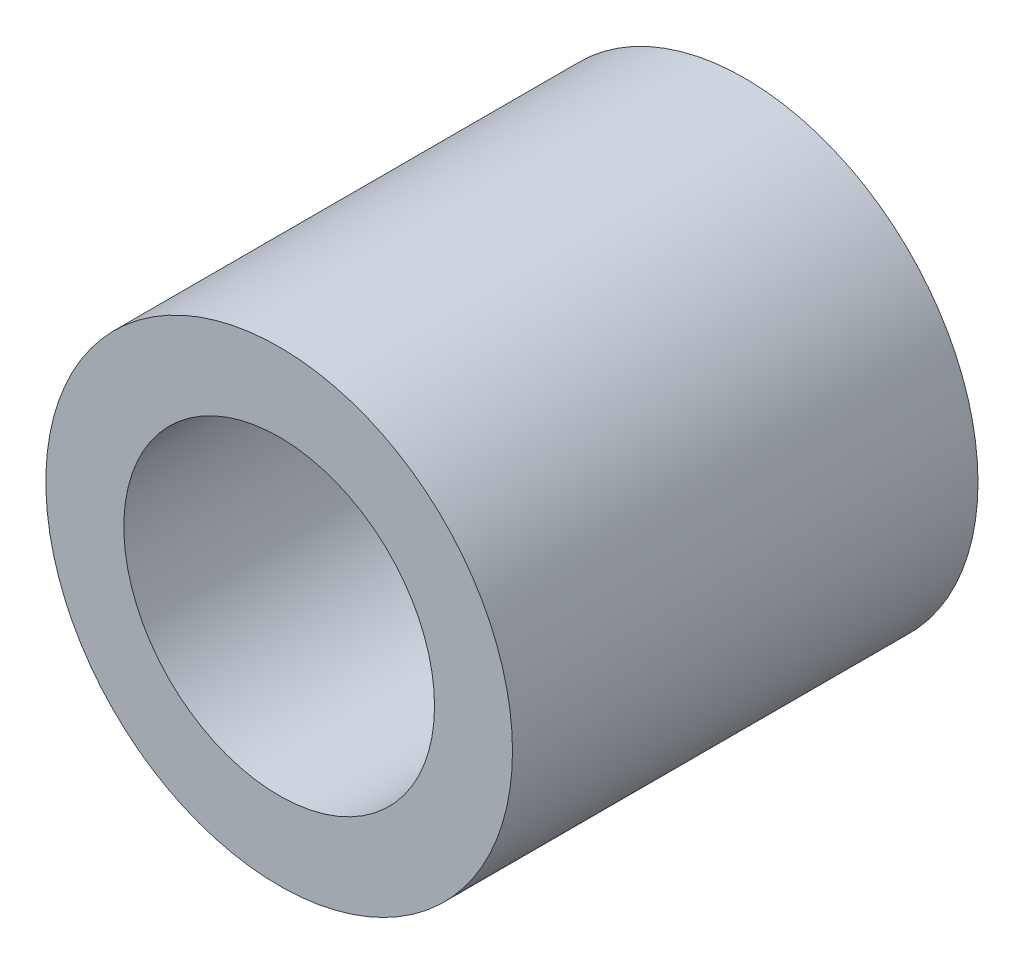
ISO-10303-21;
HEADER;
FILE_DESCRIPTION(('STEP AP214'),'2;1');
FILE_NAME('part.step','',(''),(''),'','','');
FILE_SCHEMA(('AUTOMOTIVE_DESIGN { 1 0 10303 214 1 1 1 1 }'));
ENDSEC;
DATA;
#1=APPLICATION_CONTEXT('core data for automotive mechanical design processes');
#2=APPLICATION_PROTOCOL_DEFINITION('international standard','automotive_design',2000,#1);
#3=PRODUCT_CONTEXT('',#1,'mechanical');
#4=PRODUCT('Part','Part','',(#3));
#5=PRODUCT_RELATED_PRODUCT_CATEGORY('part','',(#4));
#6=PRODUCT_DEFINITION_FORMATION('','',#4);
#7=PRODUCT_DEFINITION_CONTEXT('part definition',#1,'design');
#8=PRODUCT_DEFINITION('design','',#6,#7);
#9=PRODUCT_DEFINITION_SHAPE('','',#8);
#10=(LENGTH_UNIT() NAMED_UNIT(*) SI_UNIT(.MILLI.,.METRE.));
#11=(NAMED_UNIT(*) PLANE_ANGLE_UNIT() SI_UNIT($,.RADIAN.));
#12=(NAMED_UNIT(*) SI_UNIT($,.STERADIAN.) SOLID_ANGLE_UNIT());
#13=UNCERTAINTY_MEASURE_WITH_UNIT(LENGTH_MEASURE(1.E-05),#10,'distance_accuracy_value','');
#14=(GEOMETRIC_REPRESENTATION_CONTEXT(3) GLOBAL_UNCERTAINTY_ASSIGNED_CONTEXT((#13)) GLOBAL_UNIT_ASSIGNED_CONTEXT((#10,
#11,#12)) REPRESENTATION_CONTEXT('',''));
#15=CARTESIAN_POINT('',(0.,0.,0.));
#16=DIRECTION('',(0.,0.,1.));
#17=DIRECTION('',(1.,0.,0.));
#18=AXIS2_PLACEMENT_3D('',#15,#16,#17);
#19=CARTESIAN_POINT('',(0.,0.,6.));
#20=DIRECTION('',(0.,0.,1.));
#21=DIRECTION('',(1.,0.,0.));
#22=AXIS2_PLACEMENT_3D('',#19,#20,#21);
#23=PLANE('',#22);
#24=CARTESIAN_POINT('',(0.,0.,6.));
#25=DIRECTION('',(0.,0.,1.));
#26=DIRECTION('',(1.,0.,0.));
#27=AXIS2_PLACEMENT_3D('',#24,#25,#26);
#28=CIRCLE('',#27,6.015);
#29=CARTESIAN_POINT('',(6.015,0.,6.));
#30=VERTEX_POINT('',#29);
#31=EDGE_CURVE('E10',#30,#30,#28,.T.);
#32=ORIENTED_EDGE('',*,*,#31,.T.);
#33=EDGE_LOOP('',(#32));
#34=FACE_BOUND('',#33,.T.);
#35=CARTESIAN_POINT('',(0.,0.,6.));
#36=DIRECTION('',(0.,0.,1.));
#37=DIRECTION('',(1.,0.,0.));
#38=AXIS2_PLACEMENT_3D('',#35,#36,#37);
#39=CIRCLE('',#38,4.005);
#40=CARTESIAN_POINT('',(4.005,0.,6.));
#41=VERTEX_POINT('',#40);
#42=EDGE_CURVE('E41',#41,#41,#39,.T.);
#43=ORIENTED_EDGE('',*,*,#42,.F.);
#44=EDGE_LOOP('',(#43));
#45=FACE_BOUND('',#44,.T.);
#46=ADVANCED_FACE('F30',(#34,#45),#23,.T.);
#47=CARTESIAN_POINT('',(0.,0.,-6.));
#48=DIRECTION('',(0.,0.,1.));
#49=DIRECTION('',(1.,0.,0.));
#50=AXIS2_PLACEMENT_3D('',#47,#48,#49);
#51=PLANE('',#50);
#52=CARTESIAN_POINT('',(0.,0.,-6.));
#53=DIRECTION('',(0.,0.,1.));
#54=DIRECTION('',(1.,0.,0.));
#55=AXIS2_PLACEMENT_3D('',#52,#53,#54);
#56=CIRCLE('',#55,6.015);
#57=CARTESIAN_POINT('',(6.015,0.,-6.));
#58=VERTEX_POINT('',#57);
#59=EDGE_CURVE('E34',#58,#58,#56,.T.);
#60=ORIENTED_EDGE('',*,*,#59,.F.);
#61=EDGE_LOOP('',(#60));
#62=FACE_BOUND('',#61,.T.);
#63=CARTESIAN_POINT('',(0.,0.,-6.));
#64=DIRECTION('',(0.,0.,1.));
#65=DIRECTION('',(1.,0.,0.));
#66=AXIS2_PLACEMENT_3D('',#63,#64,#65);
#67=CIRCLE('',#66,4.005);
#68=CARTESIAN_POINT('',(4.005,0.,-6.));
#69=VERTEX_POINT('',#68);
#70=EDGE_CURVE('E43',#69,#69,#67,.T.);
#71=ORIENTED_EDGE('',*,*,#70,.T.);
#72=EDGE_LOOP('',(#71));
#73=FACE_BOUND('',#72,.T.);
#74=ADVANCED_FACE('F53',(#62,#73),#51,.F.);
#75=CARTESIAN_POINT('',(0.,0.,6.));
#76=DIRECTION('',(0.,0.,-1.));
#77=DIRECTION('',(-1.,0.,0.));
#78=AXIS2_PLACEMENT_3D('',#75,#76,#77);
#79=CYLINDRICAL_SURFACE('',#78,6.015);
#80=ORIENTED_EDGE('',*,*,#31,.F.);
#81=EDGE_LOOP('',(#80));
#82=FACE_BOUND('',#81,.T.);
#83=ORIENTED_EDGE('',*,*,#59,.T.);
#84=EDGE_LOOP('',(#83));
#85=FACE_BOUND('',#84,.T.);
#86=ADVANCED_FACE('F32',(#82,#85),#79,.T.);
#87=CARTESIAN_POINT('',(0.,0.,6.));
#88=DIRECTION('',(0.,0.,-1.));
#89=DIRECTION('',(-1.,0.,0.));
#90=AXIS2_PLACEMENT_3D('',#87,#88,#89);
#91=CYLINDRICAL_SURFACE('',#90,4.005);
#92=ORIENTED_EDGE('',*,*,#42,.T.);
#93=EDGE_LOOP('',(#92));
#94=FACE_BOUND('',#93,.T.);
#95=ORIENTED_EDGE('',*,*,#70,.F.);
#96=EDGE_LOOP('',(#95));
#97=FACE_BOUND('',#96,.T.);
#98=ADVANCED_FACE('F49',(#94,#97),#91,.F.);
#99=CLOSED_SHELL('',(#46,#74,#86,#98));
#100=MANIFOLD_SOLID_BREP('B2',#99);
#101=ADVANCED_BREP_SHAPE_REPRESENTATION('',(#18,#100),#14);
#102=SHAPE_DEFINITION_REPRESENTATION(#9,#101);
ENDSEC;
END-ISO-10303-21;
